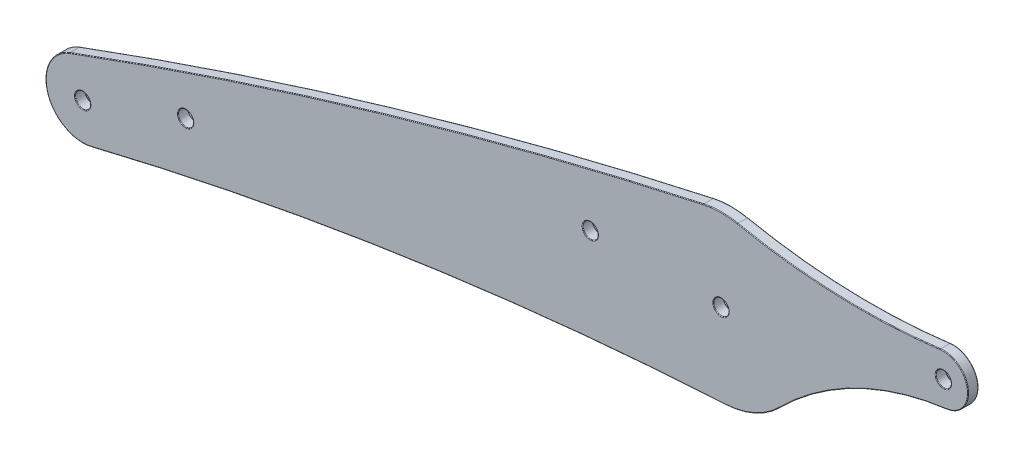
ISO-10303-21;
HEADER;
FILE_DESCRIPTION(('STEP AP214'),'2;1');
FILE_NAME('part.step','',(''),(''),'','','');
FILE_SCHEMA(('AUTOMOTIVE_DESIGN { 1 0 10303 214 1 1 1 1 }'));
ENDSEC;
DATA;
#1=APPLICATION_CONTEXT('core data for automotive mechanical design processes');
#2=APPLICATION_PROTOCOL_DEFINITION('international standard','automotive_design',2000,#1);
#3=PRODUCT_CONTEXT('',#1,'mechanical');
#4=PRODUCT('Part','Part','',(#3));
#5=PRODUCT_RELATED_PRODUCT_CATEGORY('part','',(#4));
#6=PRODUCT_DEFINITION_FORMATION('','',#4);
#7=PRODUCT_DEFINITION_CONTEXT('part definition',#1,'design');
#8=PRODUCT_DEFINITION('design','',#6,#7);
#9=PRODUCT_DEFINITION_SHAPE('','',#8);
#10=(LENGTH_UNIT() NAMED_UNIT(*) SI_UNIT(.MILLI.,.METRE.));
#11=(NAMED_UNIT(*) PLANE_ANGLE_UNIT() SI_UNIT($,.RADIAN.));
#12=(NAMED_UNIT(*) SI_UNIT($,.STERADIAN.) SOLID_ANGLE_UNIT());
#13=UNCERTAINTY_MEASURE_WITH_UNIT(LENGTH_MEASURE(1.E-05),#10,'distance_accuracy_value','');
#14=(GEOMETRIC_REPRESENTATION_CONTEXT(3) GLOBAL_UNCERTAINTY_ASSIGNED_CONTEXT((#13)) GLOBAL_UNIT_ASSIGNED_CONTEXT((#10,
#11,#12)) REPRESENTATION_CONTEXT('',''));
#15=CARTESIAN_POINT('',(0.,0.,0.));
#16=DIRECTION('',(0.,0.,1.));
#17=DIRECTION('',(1.,0.,0.));
#18=AXIS2_PLACEMENT_3D('',#15,#16,#17);
#19=CARTESIAN_POINT('',(-207.559420674233,167.991533654802,-2.5));
#20=DIRECTION('',(0.,0.,1.));
#21=DIRECTION('',(1.,0.,0.));
#22=AXIS2_PLACEMENT_3D('',#19,#20,#21);
#23=CYLINDRICAL_SURFACE('',#22,8.99999999999993);
#24=DIRECTION('',(0.,0.,1.));
#25=VECTOR('',#24,1.);
#26=CARTESIAN_POINT('',(-210.687563405126,176.430415278285,-2.5));
#27=LINE('',#26,#25);
#28=CARTESIAN_POINT('',(-210.687563405126,176.430415278285,-2.35));
#29=VERTEX_POINT('',#28);
#30=CARTESIAN_POINT('',(-210.687563405126,176.430415278285,-0.15));
#31=VERTEX_POINT('',#30);
#32=EDGE_CURVE('E152',#29,#31,#27,.T.);
#33=ORIENTED_EDGE('',*,*,#32,.F.);
#34=CARTESIAN_POINT('',(-207.559420674233,167.991533654802,-2.35));
#35=DIRECTION('',(0.,0.,1.));
#36=DIRECTION('',(1.,0.,0.));
#37=AXIS2_PLACEMENT_3D('',#34,#35,#36);
#38=CIRCLE('',#37,8.99999999999993);
#39=CARTESIAN_POINT('',(-205.431945407976,159.24660089397,-2.35));
#40=VERTEX_POINT('',#39);
#41=EDGE_CURVE('E147',#29,#40,#38,.T.);
#42=ORIENTED_EDGE('',*,*,#41,.T.);
#43=DIRECTION('',(0.,0.,1.));
#44=VECTOR('',#43,1.);
#45=CARTESIAN_POINT('',(-205.431945407976,159.24660089397,-2.5));
#46=LINE('',#45,#44);
#47=CARTESIAN_POINT('',(-205.431945407976,159.24660089397,-0.15));
#48=VERTEX_POINT('',#47);
#49=EDGE_CURVE('E149',#40,#48,#46,.T.);
#50=ORIENTED_EDGE('',*,*,#49,.T.);
#51=CARTESIAN_POINT('',(-207.559420674233,167.991533654802,-0.15));
#52=DIRECTION('',(0.,0.,1.));
#53=DIRECTION('',(1.,0.,0.));
#54=AXIS2_PLACEMENT_3D('',#51,#52,#53);
#55=CIRCLE('',#54,8.99999999999993);
#56=EDGE_CURVE('E158',#48,#31,#55,.F.);
#57=ORIENTED_EDGE('',*,*,#56,.T.);
#58=EDGE_LOOP('',(#33,#42,#50,#57));
#59=FACE_BOUND('',#58,.T.);
#60=ADVANCED_FACE('F33',(#59),#23,.T.);
#61=CARTESIAN_POINT('',(189.019563320087,-901.871125500117,-2.5));
#62=DIRECTION('',(0.,0.,1.));
#63=DIRECTION('',(1.,0.,0.));
#64=AXIS2_PLACEMENT_3D('',#61,#62,#63);
#65=CYLINDRICAL_SURFACE('',#64,1150.);
#66=DIRECTION('',(0.,0.,1.));
#67=VECTOR('',#66,1.);
#68=CARTESIAN_POINT('',(-56.8079312515751,221.547248442832,-2.5));
#69=LINE('',#68,#67);
#70=CARTESIAN_POINT('',(-56.8079312515751,221.547248442832,-2.35));
#71=VERTEX_POINT('',#70);
#72=CARTESIAN_POINT('',(-56.8079312515751,221.547248442832,-0.15));
#73=VERTEX_POINT('',#72);
#74=EDGE_CURVE('E369',#71,#73,#69,.T.);
#75=ORIENTED_EDGE('',*,*,#74,.F.);
#76=CARTESIAN_POINT('',(189.019563320087,-901.871125500117,-2.35));
#77=DIRECTION('',(0.,0.,1.));
#78=DIRECTION('',(1.,0.,0.));
#79=AXIS2_PLACEMENT_3D('',#76,#77,#78);
#80=CIRCLE('',#79,1150.);
#81=EDGE_CURVE('E241',#71,#29,#80,.T.);
#82=ORIENTED_EDGE('',*,*,#81,.T.);
#83=ORIENTED_EDGE('',*,*,#32,.T.);
#84=CARTESIAN_POINT('',(189.019563320087,-901.871125500117,-0.15));
#85=DIRECTION('',(0.,0.,1.));
#86=DIRECTION('',(1.,0.,0.));
#87=AXIS2_PLACEMENT_3D('',#84,#85,#86);
#88=CIRCLE('',#87,1150.);
#89=EDGE_CURVE('E238',#31,#73,#88,.F.);
#90=ORIENTED_EDGE('',*,*,#89,.T.);
#91=EDGE_LOOP('',(#75,#82,#83,#90));
#92=FACE_BOUND('',#91,.T.);
#93=ADVANCED_FACE('F375',(#92),#65,.T.);
#94=CARTESIAN_POINT('',(-52.5326704764156,202.00953759165,-2.5));
#95=DIRECTION('',(0.,0.,1.));
#96=DIRECTION('',(1.,0.,0.));
#97=AXIS2_PLACEMENT_3D('',#94,#95,#96);
#98=CYLINDRICAL_SURFACE('',#97,19.9999999999999);
#99=DIRECTION('',(0.,0.,1.));
#100=VECTOR('',#99,1.);
#101=CARTESIAN_POINT('',(-48.5315140921428,221.605219452422,-2.5));
#102=LINE('',#101,#100);
#103=CARTESIAN_POINT('',(-48.5315140921428,221.605219452422,-2.35));
#104=VERTEX_POINT('',#103);
#105=CARTESIAN_POINT('',(-48.5315140921428,221.605219452422,-0.15));
#106=VERTEX_POINT('',#105);
#107=EDGE_CURVE('E366',#104,#106,#102,.T.);
#108=ORIENTED_EDGE('',*,*,#107,.F.);
#109=CARTESIAN_POINT('',(-52.5326704764156,202.00953759165,-2.35));
#110=DIRECTION('',(0.,0.,1.));
#111=DIRECTION('',(1.,0.,0.));
#112=AXIS2_PLACEMENT_3D('',#109,#110,#111);
#113=CIRCLE('',#112,19.9999999999999);
#114=EDGE_CURVE('E236',#104,#71,#113,.T.);
#115=ORIENTED_EDGE('',*,*,#114,.T.);
#116=ORIENTED_EDGE('',*,*,#74,.T.);
#117=CARTESIAN_POINT('',(-52.5326704764156,202.00953759165,-0.15));
#118=DIRECTION('',(0.,0.,1.));
#119=DIRECTION('',(1.,0.,0.));
#120=AXIS2_PLACEMENT_3D('',#117,#118,#119);
#121=CIRCLE('',#120,19.9999999999999);
#122=EDGE_CURVE('E234',#73,#106,#121,.F.);
#123=ORIENTED_EDGE('',*,*,#122,.T.);
#124=EDGE_LOOP('',(#108,#115,#116,#123));
#125=FACE_BOUND('',#124,.T.);
#126=ADVANCED_FACE('F429',(#125),#98,.T.);
#127=CARTESIAN_POINT('',(-18.5228412100963,368.572833408213,-2.5));
#128=DIRECTION('',(0.,0.,1.));
#129=DIRECTION('',(1.,0.,0.));
#130=AXIS2_PLACEMENT_3D('',#127,#128,#129);
#131=CYLINDRICAL_SURFACE('',#130,150.);
#132=DIRECTION('',(0.,0.,1.));
#133=VECTOR('',#132,1.);
#134=CARTESIAN_POINT('',(0.698476803058276,219.809461122434,-2.5));
#135=LINE('',#134,#133);
#136=CARTESIAN_POINT('',(0.698476803058276,219.809461122434,-2.35));
#137=VERTEX_POINT('',#136);
#138=CARTESIAN_POINT('',(0.698476803058276,219.809461122434,-0.15));
#139=VERTEX_POINT('',#138);
#140=EDGE_CURVE('E360',#137,#139,#135,.T.);
#141=ORIENTED_EDGE('',*,*,#140,.F.);
#142=CARTESIAN_POINT('',(-18.5228412100963,368.572833408213,-2.35));
#143=DIRECTION('',(0.,0.,1.));
#144=DIRECTION('',(1.,0.,0.));
#145=AXIS2_PLACEMENT_3D('',#142,#143,#144);
#146=CIRCLE('',#145,150.);
#147=EDGE_CURVE('E232',#137,#104,#146,.F.);
#148=ORIENTED_EDGE('',*,*,#147,.T.);
#149=ORIENTED_EDGE('',*,*,#107,.T.);
#150=CARTESIAN_POINT('',(-18.5228412100963,368.572833408213,-0.15));
#151=DIRECTION('',(0.,0.,1.));
#152=DIRECTION('',(1.,0.,0.));
#153=AXIS2_PLACEMENT_3D('',#150,#151,#152);
#154=CIRCLE('',#153,150.);
#155=EDGE_CURVE('E230',#106,#139,#154,.T.);
#156=ORIENTED_EDGE('',*,*,#155,.T.);
#157=EDGE_LOOP('',(#141,#148,#149,#156));
#158=FACE_BOUND('',#157,.T.);
#159=ADVANCED_FACE('F722',(#158),#131,.F.);
#160=CARTESIAN_POINT('',(1.46732952358442,213.858926231003,-2.5));
#161=DIRECTION('',(0.,0.,1.));
#162=DIRECTION('',(1.,0.,0.));
#163=AXIS2_PLACEMENT_3D('',#160,#161,#162);
#164=CYLINDRICAL_SURFACE('',#163,5.99999999999998);
#165=DIRECTION('',(0.,0.,1.));
#166=VECTOR('',#165,1.);
#167=CARTESIAN_POINT('',(2.23764645106945,207.908580709,-2.5));
#168=LINE('',#167,#166);
#169=CARTESIAN_POINT('',(2.23764645106945,207.908580709,-2.35));
#170=VERTEX_POINT('',#169);
#171=CARTESIAN_POINT('',(2.23764645106945,207.908580709,-0.15));
#172=VERTEX_POINT('',#171);
#173=EDGE_CURVE('E356',#170,#172,#168,.T.);
#174=ORIENTED_EDGE('',*,*,#173,.F.);
#175=CARTESIAN_POINT('',(1.46732952358442,213.858926231003,-2.35));
#176=DIRECTION('',(0.,0.,1.));
#177=DIRECTION('',(1.,0.,0.));
#178=AXIS2_PLACEMENT_3D('',#175,#176,#177);
#179=CIRCLE('',#178,5.99999999999998);
#180=EDGE_CURVE('E228',#170,#137,#179,.T.);
#181=ORIENTED_EDGE('',*,*,#180,.T.);
#182=ORIENTED_EDGE('',*,*,#140,.T.);
#183=CARTESIAN_POINT('',(1.46732952358442,213.858926231003,-0.15));
#184=DIRECTION('',(0.,0.,1.));
#185=DIRECTION('',(1.,0.,0.));
#186=AXIS2_PLACEMENT_3D('',#183,#184,#185);
#187=CIRCLE('',#186,5.99999999999998);
#188=EDGE_CURVE('E226',#139,#172,#187,.F.);
#189=ORIENTED_EDGE('',*,*,#188,.T.);
#190=EDGE_LOOP('',(#174,#181,#182,#189));
#191=FACE_BOUND('',#190,.T.);
#192=ADVANCED_FACE('F714',(#191),#164,.T.);
#193=CARTESIAN_POINT('',(11.2246772717282,138.487882952289,-2.5));
#194=DIRECTION('',(0.,0.,1.));
#195=DIRECTION('',(1.,0.,0.));
#196=AXIS2_PLACEMENT_3D('',#193,#194,#195);
#197=CYLINDRICAL_SURFACE('',#196,70.);
#198=DIRECTION('',(0.,0.,1.));
#199=VECTOR('',#198,1.);
#200=CARTESIAN_POINT('',(-38.3643709768281,187.893614338459,-2.5));
#201=LINE('',#200,#199);
#202=CARTESIAN_POINT('',(-38.3643709768281,187.893614338459,-2.35));
#203=VERTEX_POINT('',#202);
#204=CARTESIAN_POINT('',(-38.3643709768281,187.893614338459,-0.15));
#205=VERTEX_POINT('',#204);
#206=EDGE_CURVE('E353',#203,#205,#201,.T.);
#207=ORIENTED_EDGE('',*,*,#206,.F.);
#208=CARTESIAN_POINT('',(11.2246772717282,138.487882952289,-2.35));
#209=DIRECTION('',(0.,0.,1.));
#210=DIRECTION('',(1.,0.,0.));
#211=AXIS2_PLACEMENT_3D('',#208,#209,#210);
#212=CIRCLE('',#211,70.);
#213=EDGE_CURVE('E224',#203,#170,#212,.F.);
#214=ORIENTED_EDGE('',*,*,#213,.T.);
#215=ORIENTED_EDGE('',*,*,#173,.T.);
#216=CARTESIAN_POINT('',(11.2246772717282,138.487882952289,-0.15));
#217=DIRECTION('',(0.,0.,1.));
#218=DIRECTION('',(1.,0.,0.));
#219=AXIS2_PLACEMENT_3D('',#216,#217,#218);
#220=CIRCLE('',#219,70.);
#221=EDGE_CURVE('E222',#172,#205,#220,.T.);
#222=ORIENTED_EDGE('',*,*,#221,.T.);
#223=EDGE_LOOP('',(#207,#214,#215,#222));
#224=FACE_BOUND('',#223,.T.);
#225=ADVANCED_FACE('F352',(#224),#197,.F.);
#226=CARTESIAN_POINT('',(-52.5326704764156,202.00953759165,-2.5));
#227=DIRECTION('',(0.,0.,1.));
#228=DIRECTION('',(1.,0.,0.));
#229=AXIS2_PLACEMENT_3D('',#226,#227,#228);
#230=CYLINDRICAL_SURFACE('',#229,20.0000000000001);
#231=DIRECTION('',(0.,0.,1.));
#232=VECTOR('',#231,1.);
#233=CARTESIAN_POINT('',(-51.4285568060865,182.04003752272,-2.5));
#234=LINE('',#233,#232);
#235=CARTESIAN_POINT('',(-51.4285568060865,182.04003752272,-2.35));
#236=VERTEX_POINT('',#235);
#237=CARTESIAN_POINT('',(-51.4285568060865,182.04003752272,-0.15));
#238=VERTEX_POINT('',#237);
#239=EDGE_CURVE('E169',#236,#238,#234,.T.);
#240=ORIENTED_EDGE('',*,*,#239,.F.);
#241=CARTESIAN_POINT('',(-52.5326704764156,202.00953759165,-2.35));
#242=DIRECTION('',(0.,0.,1.));
#243=DIRECTION('',(1.,0.,0.));
#244=AXIS2_PLACEMENT_3D('',#241,#242,#243);
#245=CIRCLE('',#244,20.0000000000001);
#246=EDGE_CURVE('E220',#236,#203,#245,.T.);
#247=ORIENTED_EDGE('',*,*,#246,.T.);
#248=ORIENTED_EDGE('',*,*,#206,.T.);
#249=CARTESIAN_POINT('',(-52.5326704764156,202.00953759165,-0.15));
#250=DIRECTION('',(0.,0.,1.));
#251=DIRECTION('',(1.,0.,0.));
#252=AXIS2_PLACEMENT_3D('',#249,#250,#251);
#253=CIRCLE('',#252,20.0000000000001);
#254=EDGE_CURVE('E218',#205,#238,#253,.F.);
#255=ORIENTED_EDGE('',*,*,#254,.T.);
#256=EDGE_LOOP('',(#240,#247,#248,#255));
#257=FACE_BOUND('',#256,.T.);
#258=ADVANCED_FACE('F358',(#257),#230,.T.);
#259=CARTESIAN_POINT('',(-4.50372581709999,-666.663715406802,-2.5));
#260=DIRECTION('',(0.,0.,1.));
#261=DIRECTION('',(1.,0.,0.));
#262=AXIS2_PLACEMENT_3D('',#259,#260,#261);
#263=CYLINDRICAL_SURFACE('',#262,850.);
#264=ORIENTED_EDGE('',*,*,#49,.F.);
#265=CARTESIAN_POINT('',(-4.50372581709999,-666.663715406802,-2.35));
#266=DIRECTION('',(0.,0.,1.));
#267=DIRECTION('',(1.,0.,0.));
#268=AXIS2_PLACEMENT_3D('',#265,#266,#267);
#269=CIRCLE('',#268,850.);
#270=EDGE_CURVE('E165',#40,#236,#269,.F.);
#271=ORIENTED_EDGE('',*,*,#270,.T.);
#272=ORIENTED_EDGE('',*,*,#239,.T.);
#273=CARTESIAN_POINT('',(-4.50372581709999,-666.663715406802,-0.15));
#274=DIRECTION('',(0.,0.,1.));
#275=DIRECTION('',(1.,0.,0.));
#276=AXIS2_PLACEMENT_3D('',#273,#274,#275);
#277=CIRCLE('',#276,850.);
#278=EDGE_CURVE('E168',#238,#48,#277,.T.);
#279=ORIENTED_EDGE('',*,*,#278,.T.);
#280=EDGE_LOOP('',(#264,#271,#272,#279));
#281=FACE_BOUND('',#280,.T.);
#282=ADVANCED_FACE('F162',(#281),#263,.F.);
#283=CARTESIAN_POINT('',(-106.031573245666,-249.336090876,-2.5));
#284=DIRECTION('',(0.,0.,1.));
#285=DIRECTION('',(1.,0.,0.));
#286=AXIS2_PLACEMENT_3D('',#283,#284,#285);
#287=PLANE('',#286);
#288=CARTESIAN_POINT('',(-52.5326704764156,202.00953759165,-2.5));
#289=DIRECTION('',(0.,0.,1.));
#290=DIRECTION('',(1.,0.,0.));
#291=AXIS2_PLACEMENT_3D('',#288,#289,#290);
#292=CIRCLE('',#291,19.8500000000001);
#293=CARTESIAN_POINT('',(-38.470633223075,187.999483762858,-2.5));
#294=VERTEX_POINT('',#293);
#295=CARTESIAN_POINT('',(-51.436837658614,182.189808773237,-2.5));
#296=VERTEX_POINT('',#295);
#297=EDGE_CURVE('E214',#294,#296,#292,.F.);
#298=ORIENTED_EDGE('',*,*,#297,.T.);
#299=CARTESIAN_POINT('',(-4.50372581709999,-666.663715406802,-2.5));
#300=DIRECTION('',(0.,0.,1.));
#301=DIRECTION('',(1.,0.,0.));
#302=AXIS2_PLACEMENT_3D('',#299,#300,#301);
#303=CIRCLE('',#302,850.15);
#304=CARTESIAN_POINT('',(-205.467403329081,159.392349773317,-2.5));
#305=VERTEX_POINT('',#304);
#306=EDGE_CURVE('E216',#296,#305,#303,.T.);
#307=ORIENTED_EDGE('',*,*,#306,.T.);
#308=CARTESIAN_POINT('',(-207.559420674233,167.991533654802,-2.5));
#309=DIRECTION('',(0.,0.,1.));
#310=DIRECTION('',(1.,0.,0.));
#311=AXIS2_PLACEMENT_3D('',#308,#309,#310);
#312=CIRCLE('',#311,8.84999999999993);
#313=CARTESIAN_POINT('',(-210.635427692944,176.289767251227,-2.5));
#314=VERTEX_POINT('',#313);
#315=EDGE_CURVE('E175',#305,#314,#312,.F.);
#316=ORIENTED_EDGE('',*,*,#315,.T.);
#317=CARTESIAN_POINT('',(189.019563320087,-901.871125500117,-2.5));
#318=DIRECTION('',(0.,0.,1.));
#319=DIRECTION('',(1.,0.,0.));
#320=AXIS2_PLACEMENT_3D('',#317,#318,#319);
#321=CIRCLE('',#320,1149.85);
#322=CARTESIAN_POINT('',(-56.7758667957613,221.400715611448,-2.5));
#323=VERTEX_POINT('',#322);
#324=EDGE_CURVE('E204',#314,#323,#321,.F.);
#325=ORIENTED_EDGE('',*,*,#324,.T.);
#326=CARTESIAN_POINT('',(-52.5326704764156,202.00953759165,-2.5));
#327=DIRECTION('',(0.,0.,1.));
#328=DIRECTION('',(1.,0.,0.));
#329=AXIS2_PLACEMENT_3D('',#326,#327,#328);
#330=CIRCLE('',#329,19.8499999999999);
#331=CARTESIAN_POINT('',(-48.5615227650248,221.458251838467,-2.5));
#332=VERTEX_POINT('',#331);
#333=EDGE_CURVE('E206',#323,#332,#330,.F.);
#334=ORIENTED_EDGE('',*,*,#333,.T.);
#335=CARTESIAN_POINT('',(-18.5228412100963,368.572833408213,-2.5));
#336=DIRECTION('',(0.,0.,1.));
#337=DIRECTION('',(1.,0.,0.));
#338=AXIS2_PLACEMENT_3D('',#335,#336,#337);
#339=CIRCLE('',#338,150.15);
#340=CARTESIAN_POINT('',(0.71769812107143,219.660697750149,-2.5));
#341=VERTEX_POINT('',#340);
#342=EDGE_CURVE('E208',#332,#341,#339,.T.);
#343=ORIENTED_EDGE('',*,*,#342,.T.);
#344=CARTESIAN_POINT('',(1.46732952358442,213.858926231003,-2.5));
#345=DIRECTION('',(0.,0.,1.));
#346=DIRECTION('',(1.,0.,0.));
#347=AXIS2_PLACEMENT_3D('',#344,#345,#346);
#348=CIRCLE('',#347,5.84999999999998);
#349=CARTESIAN_POINT('',(2.21838852788232,208.05733934705,-2.5));
#350=VERTEX_POINT('',#349);
#351=EDGE_CURVE('E210',#341,#350,#348,.F.);
#352=ORIENTED_EDGE('',*,*,#351,.T.);
#353=CARTESIAN_POINT('',(11.2246772717282,138.487882952289,-2.5));
#354=DIRECTION('',(0.,0.,1.));
#355=DIRECTION('',(1.,0.,0.));
#356=AXIS2_PLACEMENT_3D('',#353,#354,#355);
#357=CIRCLE('',#356,70.15);
#358=EDGE_CURVE('E212',#350,#294,#357,.T.);
#359=ORIENTED_EDGE('',*,*,#358,.T.);
#360=EDGE_LOOP('',(#298,#307,#316,#325,#334,#343,#352,#359));
#361=FACE_BOUND('',#360,.T.);
#362=CARTESIAN_POINT('',(1.46732952358442,213.858926231003,-2.5));
#363=DIRECTION('',(0.,0.,1.));
#364=DIRECTION('',(1.,0.,0.));
#365=AXIS2_PLACEMENT_3D('',#362,#363,#364);
#366=CIRCLE('',#365,1.99999999999999);
#367=CARTESIAN_POINT('',(3.46732952358441,213.858926231003,-2.5));
#368=VERTEX_POINT('',#367);
#369=EDGE_CURVE('E200',#368,#368,#366,.T.);
#370=ORIENTED_EDGE('',*,*,#369,.T.);
#371=EDGE_LOOP('',(#370));
#372=FACE_BOUND('',#371,.T.);
#373=CARTESIAN_POINT('',(-52.5326704764156,202.00953759165,-2.5));
#374=DIRECTION('',(0.,0.,1.));
#375=DIRECTION('',(1.,0.,0.));
#376=AXIS2_PLACEMENT_3D('',#373,#374,#375);
#377=CIRCLE('',#376,1.99999999999999);
#378=CARTESIAN_POINT('',(-50.5326704764156,202.00953759165,-2.5));
#379=VERTEX_POINT('',#378);
#380=EDGE_CURVE('E197',#379,#379,#377,.T.);
#381=ORIENTED_EDGE('',*,*,#380,.T.);
#382=EDGE_LOOP('',(#381));
#383=FACE_BOUND('',#382,.T.);
#384=CARTESIAN_POINT('',(-84.2826704764156,202.216511620711,-2.5));
#385=DIRECTION('',(0.,0.,1.));
#386=DIRECTION('',(1.,0.,0.));
#387=AXIS2_PLACEMENT_3D('',#384,#385,#386);
#388=CIRCLE('',#387,2.);
#389=CARTESIAN_POINT('',(-82.2826704764156,202.216511620711,-2.5));
#390=VERTEX_POINT('',#389);
#391=EDGE_CURVE('E194',#390,#390,#388,.T.);
#392=ORIENTED_EDGE('',*,*,#391,.T.);
#393=EDGE_LOOP('',(#392));
#394=FACE_BOUND('',#393,.T.);
#395=CARTESIAN_POINT('',(-182.559420674233,176.697772359895,-2.5));
#396=DIRECTION('',(0.,0.,1.));
#397=DIRECTION('',(1.,0.,0.));
#398=AXIS2_PLACEMENT_3D('',#395,#396,#397);
#399=CIRCLE('',#398,1.99999999999999);
#400=CARTESIAN_POINT('',(-180.559420674233,176.697772359895,-2.5));
#401=VERTEX_POINT('',#400);
#402=EDGE_CURVE('E188',#401,#401,#399,.T.);
#403=ORIENTED_EDGE('',*,*,#402,.T.);
#404=EDGE_LOOP('',(#403));
#405=FACE_BOUND('',#404,.T.);
#406=CARTESIAN_POINT('',(-207.559420674233,167.991533654802,-2.5));
#407=DIRECTION('',(0.,0.,1.));
#408=DIRECTION('',(1.,0.,0.));
#409=AXIS2_PLACEMENT_3D('',#406,#407,#408);
#410=CIRCLE('',#409,1.99999999999999);
#411=CARTESIAN_POINT('',(-205.559420674233,167.991533654802,-2.5));
#412=VERTEX_POINT('',#411);
#413=EDGE_CURVE('E185',#412,#412,#410,.T.);
#414=ORIENTED_EDGE('',*,*,#413,.T.);
#415=EDGE_LOOP('',(#414));
#416=FACE_BOUND('',#415,.T.);
#417=ADVANCED_FACE('F391',(#361,#372,#383,#394,#405,#416),#287,.F.);
#418=CARTESIAN_POINT('',(-106.031573245666,-249.336090876,0.));
#419=DIRECTION('',(0.,0.,1.));
#420=DIRECTION('',(1.,0.,0.));
#421=AXIS2_PLACEMENT_3D('',#418,#419,#420);
#422=PLANE('',#421);
#423=CARTESIAN_POINT('',(-52.5326704764156,202.00953759165,0.));
#424=DIRECTION('',(0.,0.,1.));
#425=DIRECTION('',(1.,0.,0.));
#426=AXIS2_PLACEMENT_3D('',#423,#424,#425);
#427=CIRCLE('',#426,19.8499999999999);
#428=CARTESIAN_POINT('',(-48.5615227650248,221.458251838467,0.));
#429=VERTEX_POINT('',#428);
#430=CARTESIAN_POINT('',(-56.7758667957614,221.400715611448,0.));
#431=VERTEX_POINT('',#430);
#432=EDGE_CURVE('E42',#429,#431,#427,.T.);
#433=ORIENTED_EDGE('',*,*,#432,.T.);
#434=CARTESIAN_POINT('',(189.019563320087,-901.871125500117,0.));
#435=DIRECTION('',(0.,0.,1.));
#436=DIRECTION('',(1.,0.,0.));
#437=AXIS2_PLACEMENT_3D('',#434,#435,#436);
#438=CIRCLE('',#437,1149.85);
#439=CARTESIAN_POINT('',(-210.635427692944,176.289767251227,0.));
#440=VERTEX_POINT('',#439);
#441=EDGE_CURVE('E11',#431,#440,#438,.T.);
#442=ORIENTED_EDGE('',*,*,#441,.T.);
#443=CARTESIAN_POINT('',(-207.559420674233,167.991533654802,0.));
#444=DIRECTION('',(0.,0.,1.));
#445=DIRECTION('',(1.,0.,0.));
#446=AXIS2_PLACEMENT_3D('',#443,#444,#445);
#447=CIRCLE('',#446,8.84999999999993);
#448=CARTESIAN_POINT('',(-205.467403329081,159.392349773317,0.));
#449=VERTEX_POINT('',#448);
#450=EDGE_CURVE('E288',#440,#449,#447,.T.);
#451=ORIENTED_EDGE('',*,*,#450,.T.);
#452=CARTESIAN_POINT('',(-4.50372581709999,-666.663715406802,0.));
#453=DIRECTION('',(0.,0.,1.));
#454=DIRECTION('',(1.,0.,0.));
#455=AXIS2_PLACEMENT_3D('',#452,#453,#454);
#456=CIRCLE('',#455,850.15);
#457=CARTESIAN_POINT('',(-51.436837658614,182.189808773237,0.));
#458=VERTEX_POINT('',#457);
#459=EDGE_CURVE('E290',#449,#458,#456,.F.);
#460=ORIENTED_EDGE('',*,*,#459,.T.);
#461=CARTESIAN_POINT('',(-52.5326704764156,202.00953759165,0.));
#462=DIRECTION('',(0.,0.,1.));
#463=DIRECTION('',(1.,0.,0.));
#464=AXIS2_PLACEMENT_3D('',#461,#462,#463);
#465=CIRCLE('',#464,19.8500000000001);
#466=CARTESIAN_POINT('',(-38.4706332230749,187.999483762858,0.));
#467=VERTEX_POINT('',#466);
#468=EDGE_CURVE('E292',#458,#467,#465,.T.);
#469=ORIENTED_EDGE('',*,*,#468,.T.);
#470=CARTESIAN_POINT('',(11.2246772717282,138.487882952289,0.));
#471=DIRECTION('',(0.,0.,1.));
#472=DIRECTION('',(1.,0.,0.));
#473=AXIS2_PLACEMENT_3D('',#470,#471,#472);
#474=CIRCLE('',#473,70.15);
#475=CARTESIAN_POINT('',(2.21838852788233,208.05733934705,0.));
#476=VERTEX_POINT('',#475);
#477=EDGE_CURVE('E294',#467,#476,#474,.F.);
#478=ORIENTED_EDGE('',*,*,#477,.T.);
#479=CARTESIAN_POINT('',(1.46732952358442,213.858926231003,0.));
#480=DIRECTION('',(0.,0.,1.));
#481=DIRECTION('',(1.,0.,0.));
#482=AXIS2_PLACEMENT_3D('',#479,#480,#481);
#483=CIRCLE('',#482,5.84999999999998);
#484=CARTESIAN_POINT('',(0.717698121071431,219.660697750149,0.));
#485=VERTEX_POINT('',#484);
#486=EDGE_CURVE('E296',#476,#485,#483,.T.);
#487=ORIENTED_EDGE('',*,*,#486,.T.);
#488=CARTESIAN_POINT('',(-18.5228412100963,368.572833408213,0.));
#489=DIRECTION('',(0.,0.,1.));
#490=DIRECTION('',(1.,0.,0.));
#491=AXIS2_PLACEMENT_3D('',#488,#489,#490);
#492=CIRCLE('',#491,150.15);
#493=EDGE_CURVE('E53',#485,#429,#492,.F.);
#494=ORIENTED_EDGE('',*,*,#493,.T.);
#495=EDGE_LOOP('',(#433,#442,#451,#460,#469,#478,#487,#494));
#496=FACE_BOUND('',#495,.T.);
#497=CARTESIAN_POINT('',(1.46732952358442,213.858926231003,0.));
#498=DIRECTION('',(0.,0.,1.));
#499=DIRECTION('',(1.,0.,0.));
#500=AXIS2_PLACEMENT_3D('',#497,#498,#499);
#501=CIRCLE('',#500,1.99999999999999);
#502=CARTESIAN_POINT('',(3.46732952358441,213.858926231003,0.));
#503=VERTEX_POINT('',#502);
#504=EDGE_CURVE('E285',#503,#503,#501,.F.);
#505=ORIENTED_EDGE('',*,*,#504,.T.);
#506=EDGE_LOOP('',(#505));
#507=FACE_BOUND('',#506,.T.);
#508=CARTESIAN_POINT('',(-52.5326704764156,202.00953759165,0.));
#509=DIRECTION('',(0.,0.,1.));
#510=DIRECTION('',(1.,0.,0.));
#511=AXIS2_PLACEMENT_3D('',#508,#509,#510);
#512=CIRCLE('',#511,1.99999999999999);
#513=CARTESIAN_POINT('',(-50.5326704764156,202.00953759165,0.));
#514=VERTEX_POINT('',#513);
#515=EDGE_CURVE('E282',#514,#514,#512,.F.);
#516=ORIENTED_EDGE('',*,*,#515,.T.);
#517=EDGE_LOOP('',(#516));
#518=FACE_BOUND('',#517,.T.);
#519=CARTESIAN_POINT('',(-84.2826704764156,202.216511620711,0.));
#520=DIRECTION('',(0.,0.,1.));
#521=DIRECTION('',(1.,0.,0.));
#522=AXIS2_PLACEMENT_3D('',#519,#520,#521);
#523=CIRCLE('',#522,2.);
#524=CARTESIAN_POINT('',(-82.2826704764156,202.216511620711,0.));
#525=VERTEX_POINT('',#524);
#526=EDGE_CURVE('E279',#525,#525,#523,.F.);
#527=ORIENTED_EDGE('',*,*,#526,.T.);
#528=EDGE_LOOP('',(#527));
#529=FACE_BOUND('',#528,.T.);
#530=CARTESIAN_POINT('',(-182.559420674233,176.697772359895,0.));
#531=DIRECTION('',(0.,0.,1.));
#532=DIRECTION('',(1.,0.,0.));
#533=AXIS2_PLACEMENT_3D('',#530,#531,#532);
#534=CIRCLE('',#533,1.99999999999999);
#535=CARTESIAN_POINT('',(-180.559420674233,176.697772359895,0.));
#536=VERTEX_POINT('',#535);
#537=EDGE_CURVE('E276',#536,#536,#534,.F.);
#538=ORIENTED_EDGE('',*,*,#537,.T.);
#539=EDGE_LOOP('',(#538));
#540=FACE_BOUND('',#539,.T.);
#541=CARTESIAN_POINT('',(-207.559420674233,167.991533654802,0.));
#542=DIRECTION('',(0.,0.,1.));
#543=DIRECTION('',(1.,0.,0.));
#544=AXIS2_PLACEMENT_3D('',#541,#542,#543);
#545=CIRCLE('',#544,1.99999999999999);
#546=CARTESIAN_POINT('',(-205.559420674233,167.991533654802,0.));
#547=VERTEX_POINT('',#546);
#548=EDGE_CURVE('E273',#547,#547,#545,.F.);
#549=ORIENTED_EDGE('',*,*,#548,.T.);
#550=EDGE_LOOP('',(#549));
#551=FACE_BOUND('',#550,.T.);
#552=ADVANCED_FACE('F387',(#496,#507,#518,#529,#540,#551),#422,.T.);
#553=CARTESIAN_POINT('',(1.46732952358442,213.858926231003,0.));
#554=DIRECTION('',(0.,0.,1.));
#555=DIRECTION('',(1.,0.,0.));
#556=AXIS2_PLACEMENT_3D('',#553,#554,#555);
#557=CYLINDRICAL_SURFACE('',#556,1.84999999999999);
#558=CARTESIAN_POINT('',(1.46732952358442,213.858926231003,-2.35));
#559=DIRECTION('',(0.,0.,1.));
#560=DIRECTION('',(1.,0.,0.));
#561=AXIS2_PLACEMENT_3D('',#558,#559,#560);
#562=CIRCLE('',#561,1.84999999999999);
#563=CARTESIAN_POINT('',(3.31732952358441,213.858926231003,-2.35));
#564=VERTEX_POINT('',#563);
#565=EDGE_CURVE('E246',#564,#564,#562,.F.);
#566=ORIENTED_EDGE('',*,*,#565,.T.);
#567=EDGE_LOOP('',(#566));
#568=FACE_BOUND('',#567,.T.);
#569=CARTESIAN_POINT('',(1.46732952358442,213.858926231003,-0.15));
#570=DIRECTION('',(0.,0.,1.));
#571=DIRECTION('',(1.,0.,0.));
#572=AXIS2_PLACEMENT_3D('',#569,#570,#571);
#573=CIRCLE('',#572,1.84999999999999);
#574=CARTESIAN_POINT('',(3.31732952358441,213.858926231003,-0.15));
#575=VERTEX_POINT('',#574);
#576=EDGE_CURVE('E157',#575,#575,#573,.T.);
#577=ORIENTED_EDGE('',*,*,#576,.T.);
#578=EDGE_LOOP('',(#577));
#579=FACE_BOUND('',#578,.T.);
#580=ADVANCED_FACE('F390',(#568,#579),#557,.F.);
#581=CARTESIAN_POINT('',(-52.5326704764156,202.00953759165,0.));
#582=DIRECTION('',(0.,0.,1.));
#583=DIRECTION('',(1.,0.,0.));
#584=AXIS2_PLACEMENT_3D('',#581,#582,#583);
#585=CYLINDRICAL_SURFACE('',#584,1.84999999999999);
#586=CARTESIAN_POINT('',(-52.5326704764156,202.00953759165,-2.35));
#587=DIRECTION('',(0.,0.,1.));
#588=DIRECTION('',(1.,0.,0.));
#589=AXIS2_PLACEMENT_3D('',#586,#587,#588);
#590=CIRCLE('',#589,1.84999999999999);
#591=CARTESIAN_POINT('',(-50.6826704764156,202.00953759165,-2.35));
#592=VERTEX_POINT('',#591);
#593=EDGE_CURVE('E252',#592,#592,#590,.F.);
#594=ORIENTED_EDGE('',*,*,#593,.T.);
#595=EDGE_LOOP('',(#594));
#596=FACE_BOUND('',#595,.T.);
#597=CARTESIAN_POINT('',(-52.5326704764156,202.00953759165,-0.15));
#598=DIRECTION('',(0.,0.,1.));
#599=DIRECTION('',(1.,0.,0.));
#600=AXIS2_PLACEMENT_3D('',#597,#598,#599);
#601=CIRCLE('',#600,1.84999999999999);
#602=CARTESIAN_POINT('',(-50.6826704764156,202.00953759165,-0.15));
#603=VERTEX_POINT('',#602);
#604=EDGE_CURVE('E249',#603,#603,#601,.T.);
#605=ORIENTED_EDGE('',*,*,#604,.T.);
#606=EDGE_LOOP('',(#605));
#607=FACE_BOUND('',#606,.T.);
#608=ADVANCED_FACE('F664',(#596,#607),#585,.F.);
#609=CARTESIAN_POINT('',(-84.2826704764156,202.216511620711,0.));
#610=DIRECTION('',(0.,0.,1.));
#611=DIRECTION('',(1.,0.,0.));
#612=AXIS2_PLACEMENT_3D('',#609,#610,#611);
#613=CYLINDRICAL_SURFACE('',#612,1.85);
#614=CARTESIAN_POINT('',(-84.2826704764156,202.216511620711,-2.35));
#615=DIRECTION('',(0.,0.,1.));
#616=DIRECTION('',(1.,0.,0.));
#617=AXIS2_PLACEMENT_3D('',#614,#615,#616);
#618=CIRCLE('',#617,1.85);
#619=CARTESIAN_POINT('',(-82.4326704764156,202.216511620711,-2.35));
#620=VERTEX_POINT('',#619);
#621=EDGE_CURVE('E258',#620,#620,#618,.F.);
#622=ORIENTED_EDGE('',*,*,#621,.T.);
#623=EDGE_LOOP('',(#622));
#624=FACE_BOUND('',#623,.T.);
#625=CARTESIAN_POINT('',(-84.2826704764156,202.216511620711,-0.15));
#626=DIRECTION('',(0.,0.,1.));
#627=DIRECTION('',(1.,0.,0.));
#628=AXIS2_PLACEMENT_3D('',#625,#626,#627);
#629=CIRCLE('',#628,1.85);
#630=CARTESIAN_POINT('',(-82.4326704764156,202.216511620711,-0.15));
#631=VERTEX_POINT('',#630);
#632=EDGE_CURVE('E255',#631,#631,#629,.T.);
#633=ORIENTED_EDGE('',*,*,#632,.T.);
#634=EDGE_LOOP('',(#633));
#635=FACE_BOUND('',#634,.T.);
#636=ADVANCED_FACE('F421',(#624,#635),#613,.F.);
#637=CARTESIAN_POINT('',(-182.559420674233,176.697772359895,0.));
#638=DIRECTION('',(0.,0.,1.));
#639=DIRECTION('',(1.,0.,0.));
#640=AXIS2_PLACEMENT_3D('',#637,#638,#639);
#641=CYLINDRICAL_SURFACE('',#640,1.84999999999999);
#642=CARTESIAN_POINT('',(-182.559420674233,176.697772359895,-2.35));
#643=DIRECTION('',(0.,0.,1.));
#644=DIRECTION('',(1.,0.,0.));
#645=AXIS2_PLACEMENT_3D('',#642,#643,#644);
#646=CIRCLE('',#645,1.84999999999999);
#647=CARTESIAN_POINT('',(-180.709420674233,176.697772359895,-2.35));
#648=VERTEX_POINT('',#647);
#649=EDGE_CURVE('E264',#648,#648,#646,.F.);
#650=ORIENTED_EDGE('',*,*,#649,.T.);
#651=EDGE_LOOP('',(#650));
#652=FACE_BOUND('',#651,.T.);
#653=CARTESIAN_POINT('',(-182.559420674233,176.697772359895,-0.15));
#654=DIRECTION('',(0.,0.,1.));
#655=DIRECTION('',(1.,0.,0.));
#656=AXIS2_PLACEMENT_3D('',#653,#654,#655);
#657=CIRCLE('',#656,1.84999999999999);
#658=CARTESIAN_POINT('',(-180.709420674233,176.697772359895,-0.15));
#659=VERTEX_POINT('',#658);
#660=EDGE_CURVE('E261',#659,#659,#657,.T.);
#661=ORIENTED_EDGE('',*,*,#660,.T.);
#662=EDGE_LOOP('',(#661));
#663=FACE_BOUND('',#662,.T.);
#664=ADVANCED_FACE('F411',(#652,#663),#641,.F.);
#665=CARTESIAN_POINT('',(-207.559420674233,167.991533654802,0.));
#666=DIRECTION('',(0.,0.,1.));
#667=DIRECTION('',(1.,0.,0.));
#668=AXIS2_PLACEMENT_3D('',#665,#666,#667);
#669=CYLINDRICAL_SURFACE('',#668,1.84999999999999);
#670=CARTESIAN_POINT('',(-207.559420674233,167.991533654802,-2.35));
#671=DIRECTION('',(0.,0.,1.));
#672=DIRECTION('',(1.,0.,0.));
#673=AXIS2_PLACEMENT_3D('',#670,#671,#672);
#674=CIRCLE('',#673,1.84999999999999);
#675=CARTESIAN_POINT('',(-205.709420674233,167.991533654802,-2.35));
#676=VERTEX_POINT('',#675);
#677=EDGE_CURVE('E270',#676,#676,#674,.F.);
#678=ORIENTED_EDGE('',*,*,#677,.T.);
#679=EDGE_LOOP('',(#678));
#680=FACE_BOUND('',#679,.T.);
#681=CARTESIAN_POINT('',(-207.559420674233,167.991533654802,-0.15));
#682=DIRECTION('',(0.,0.,1.));
#683=DIRECTION('',(1.,0.,0.));
#684=AXIS2_PLACEMENT_3D('',#681,#682,#683);
#685=CIRCLE('',#684,1.84999999999999);
#686=CARTESIAN_POINT('',(-205.709420674233,167.991533654802,-0.15));
#687=VERTEX_POINT('',#686);
#688=EDGE_CURVE('E267',#687,#687,#685,.T.);
#689=ORIENTED_EDGE('',*,*,#688,.T.);
#690=EDGE_LOOP('',(#689));
#691=FACE_BOUND('',#690,.T.);
#692=ADVANCED_FACE('F408',(#680,#691),#669,.F.);
#693=CARTESIAN_POINT('',(-18.5228412100963,368.572833408213,-2.35));
#694=DIRECTION('',(0.,0.,1.));
#695=DIRECTION('',(1.,0.,0.));
#696=AXIS2_PLACEMENT_3D('',#693,#694,#695);
#697=TOROIDAL_SURFACE('',#696,150.15,0.15);
#698=CARTESIAN_POINT('',(0.71769812107143,219.660697750149,-2.35));
#699=DIRECTION('',(0.991755815238526,0.128142120087688,0.));
#700=DIRECTION('',(-0.128142120087688,0.991755815238526,0.));
#701=AXIS2_PLACEMENT_3D('',#698,#699,#700);
#702=CIRCLE('',#701,0.15);
#703=EDGE_CURVE('E311',#341,#137,#702,.T.);
#704=ORIENTED_EDGE('',*,*,#703,.F.);
#705=ORIENTED_EDGE('',*,*,#342,.F.);
#706=CARTESIAN_POINT('',(-48.5615227650248,221.458251838467,-2.35));
#707=DIRECTION('',(-0.979784093038607,0.200057819213632,0.));
#708=DIRECTION('',(-0.200057819213632,-0.979784093038607,0.));
#709=AXIS2_PLACEMENT_3D('',#706,#707,#708);
#710=CIRCLE('',#709,0.15);
#711=EDGE_CURVE('E170',#104,#332,#710,.T.);
#712=ORIENTED_EDGE('',*,*,#711,.F.);
#713=ORIENTED_EDGE('',*,*,#147,.F.);
#714=EDGE_LOOP('',(#704,#705,#712,#713));
#715=FACE_BOUND('',#714,.T.);
#716=ADVANCED_FACE('F410',(#715),#697,.T.);
#717=CARTESIAN_POINT('',(-52.5326704764156,202.00953759165,-2.35));
#718=DIRECTION('',(0.,0.,1.));
#719=DIRECTION('',(1.,0.,0.));
#720=AXIS2_PLACEMENT_3D('',#717,#718,#719);
#721=TOROIDAL_SURFACE('',#720,19.8499999999999,0.15);
#722=ORIENTED_EDGE('',*,*,#711,.T.);
#723=ORIENTED_EDGE('',*,*,#333,.F.);
#724=CARTESIAN_POINT('',(-56.7758667957614,221.400715611448,-2.35));
#725=DIRECTION('',(-0.97688554255908,-0.213763038757994,0.));
#726=DIRECTION('',(0.213763038757994,-0.97688554255908,0.));
#727=AXIS2_PLACEMENT_3D('',#724,#725,#726);
#728=CIRCLE('',#727,0.15);
#729=EDGE_CURVE('E308',#71,#323,#728,.T.);
#730=ORIENTED_EDGE('',*,*,#729,.F.);
#731=ORIENTED_EDGE('',*,*,#114,.F.);
#732=EDGE_LOOP('',(#722,#723,#730,#731));
#733=FACE_BOUND('',#732,.T.);
#734=ADVANCED_FACE('F418',(#733),#721,.T.);
#735=CARTESIAN_POINT('',(1.46732952358442,213.858926231003,-2.35));
#736=DIRECTION('',(0.,0.,1.));
#737=DIRECTION('',(1.,0.,0.));
#738=AXIS2_PLACEMENT_3D('',#735,#736,#737);
#739=TOROIDAL_SURFACE('',#738,5.84999999999998,0.15);
#740=ORIENTED_EDGE('',*,*,#703,.T.);
#741=ORIENTED_EDGE('',*,*,#180,.F.);
#742=CARTESIAN_POINT('',(2.21838852788232,208.05733934705,-2.35));
#743=DIRECTION('',(-0.991724253667289,-0.128386154580855,0.));
#744=DIRECTION('',(0.128386154580855,-0.991724253667289,0.));
#745=AXIS2_PLACEMENT_3D('',#742,#743,#744);
#746=CIRCLE('',#745,0.15);
#747=EDGE_CURVE('E305',#350,#170,#746,.T.);
#748=ORIENTED_EDGE('',*,*,#747,.F.);
#749=ORIENTED_EDGE('',*,*,#351,.F.);
#750=EDGE_LOOP('',(#740,#741,#748,#749));
#751=FACE_BOUND('',#750,.T.);
#752=ADVANCED_FACE('F450',(#751),#739,.T.);
#753=CARTESIAN_POINT('',(189.019563320087,-901.871125500117,-2.35));
#754=DIRECTION('',(0.,0.,1.));
#755=DIRECTION('',(1.,0.,0.));
#756=AXIS2_PLACEMENT_3D('',#753,#754,#755);
#757=TOROIDAL_SURFACE('',#756,1149.85,0.15);
#758=ORIENTED_EDGE('',*,*,#729,.T.);
#759=ORIENTED_EDGE('',*,*,#324,.F.);
#760=CARTESIAN_POINT('',(-210.635427692944,176.289767251227,-2.35));
#761=DIRECTION('',(-0.937653513720353,-0.347571414543654,0.));
#762=DIRECTION('',(0.347571414543654,-0.937653513720353,0.));
#763=AXIS2_PLACEMENT_3D('',#760,#761,#762);
#764=CIRCLE('',#763,0.15);
#765=EDGE_CURVE('E303',#29,#314,#764,.T.);
#766=ORIENTED_EDGE('',*,*,#765,.F.);
#767=ORIENTED_EDGE('',*,*,#81,.F.);
#768=EDGE_LOOP('',(#758,#759,#766,#767));
#769=FACE_BOUND('',#768,.T.);
#770=ADVANCED_FACE('F446',(#769),#757,.T.);
#771=CARTESIAN_POINT('',(11.2246772717282,138.487882952289,-2.35));
#772=DIRECTION('',(0.,0.,1.));
#773=DIRECTION('',(1.,0.,0.));
#774=AXIS2_PLACEMENT_3D('',#771,#772,#773);
#775=TOROIDAL_SURFACE('',#774,70.15,0.15);
#776=ORIENTED_EDGE('',*,*,#747,.T.);
#777=ORIENTED_EDGE('',*,*,#213,.F.);
#778=CARTESIAN_POINT('',(-38.470633223075,187.999483762858,-2.35));
#779=DIRECTION('',(-0.705796162659513,-0.708414974979429,0.));
#780=DIRECTION('',(0.70841497497943,-0.705796162659514,0.));
#781=AXIS2_PLACEMENT_3D('',#778,#779,#780);
#782=CIRCLE('',#781,0.15);
#783=EDGE_CURVE('E179',#294,#203,#782,.T.);
#784=ORIENTED_EDGE('',*,*,#783,.F.);
#785=ORIENTED_EDGE('',*,*,#358,.F.);
#786=EDGE_LOOP('',(#776,#777,#784,#785));
#787=FACE_BOUND('',#786,.T.);
#788=ADVANCED_FACE('F443',(#787),#775,.T.);
#789=CARTESIAN_POINT('',(-207.559420674233,167.991533654802,-2.35));
#790=DIRECTION('',(0.,0.,1.));
#791=DIRECTION('',(1.,0.,0.));
#792=AXIS2_PLACEMENT_3D('',#789,#790,#791);
#793=TOROIDAL_SURFACE('',#792,8.84999999999993,0.15);
#794=ORIENTED_EDGE('',*,*,#765,.T.);
#795=ORIENTED_EDGE('',*,*,#315,.F.);
#796=CARTESIAN_POINT('',(-205.467403329081,159.392349773317,-2.35));
#797=DIRECTION('',(0.971659195647982,0.236386140695084,0.));
#798=DIRECTION('',(-0.236386140695084,0.971659195647982,0.));
#799=AXIS2_PLACEMENT_3D('',#796,#797,#798);
#800=CIRCLE('',#799,0.15);
#801=EDGE_CURVE('E173',#40,#305,#800,.T.);
#802=ORIENTED_EDGE('',*,*,#801,.F.);
#803=ORIENTED_EDGE('',*,*,#41,.F.);
#804=EDGE_LOOP('',(#794,#795,#802,#803));
#805=FACE_BOUND('',#804,.T.);
#806=ADVANCED_FACE('F174',(#805),#793,.T.);
#807=CARTESIAN_POINT('',(-52.5326704764156,202.00953759165,-2.35));
#808=DIRECTION('',(0.,0.,1.));
#809=DIRECTION('',(1.,0.,0.));
#810=AXIS2_PLACEMENT_3D('',#807,#808,#809);
#811=TOROIDAL_SURFACE('',#810,19.8500000000001,0.15);
#812=ORIENTED_EDGE('',*,*,#783,.T.);
#813=ORIENTED_EDGE('',*,*,#246,.F.);
#814=CARTESIAN_POINT('',(-51.436837658614,182.189808773237,-2.35));
#815=DIRECTION('',(-0.998475003446495,-0.0552056835164823,0.));
#816=DIRECTION('',(0.0552056835164823,-0.998475003446495,0.));
#817=AXIS2_PLACEMENT_3D('',#814,#815,#816);
#818=CIRCLE('',#817,0.15);
#819=EDGE_CURVE('E180',#296,#236,#818,.T.);
#820=ORIENTED_EDGE('',*,*,#819,.F.);
#821=ORIENTED_EDGE('',*,*,#297,.F.);
#822=EDGE_LOOP('',(#812,#813,#820,#821));
#823=FACE_BOUND('',#822,.T.);
#824=ADVANCED_FACE('F437',(#823),#811,.T.);
#825=CARTESIAN_POINT('',(-4.50372581709999,-666.663715406802,-2.35));
#826=DIRECTION('',(0.,0.,1.));
#827=DIRECTION('',(1.,0.,0.));
#828=AXIS2_PLACEMENT_3D('',#825,#826,#827);
#829=TOROIDAL_SURFACE('',#828,850.15,0.15);
#830=ORIENTED_EDGE('',*,*,#801,.T.);
#831=ORIENTED_EDGE('',*,*,#306,.F.);
#832=ORIENTED_EDGE('',*,*,#819,.T.);
#833=ORIENTED_EDGE('',*,*,#270,.F.);
#834=EDGE_LOOP('',(#830,#831,#832,#833));
#835=FACE_BOUND('',#834,.T.);
#836=ADVANCED_FACE('F182',(#835),#829,.T.);
#837=CARTESIAN_POINT('',(1.46732952358442,213.858926231003,-2.35));
#838=DIRECTION('',(0.,0.,1.));
#839=DIRECTION('',(1.,0.,0.));
#840=AXIS2_PLACEMENT_3D('',#837,#838,#839);
#841=TOROIDAL_SURFACE('',#840,1.99999999999999,0.15);
#842=ORIENTED_EDGE('',*,*,#565,.F.);
#843=EDGE_LOOP('',(#842));
#844=FACE_BOUND('',#843,.T.);
#845=ORIENTED_EDGE('',*,*,#369,.F.);
#846=EDGE_LOOP('',(#845));
#847=FACE_BOUND('',#846,.T.);
#848=ADVANCED_FACE('F436',(#844,#847),#841,.T.);
#849=CARTESIAN_POINT('',(-52.5326704764156,202.00953759165,-2.35));
#850=DIRECTION('',(0.,0.,1.));
#851=DIRECTION('',(1.,0.,0.));
#852=AXIS2_PLACEMENT_3D('',#849,#850,#851);
#853=TOROIDAL_SURFACE('',#852,1.99999999999999,0.15);
#854=ORIENTED_EDGE('',*,*,#593,.F.);
#855=EDGE_LOOP('',(#854));
#856=FACE_BOUND('',#855,.T.);
#857=ORIENTED_EDGE('',*,*,#380,.F.);
#858=EDGE_LOOP('',(#857));
#859=FACE_BOUND('',#858,.T.);
#860=ADVANCED_FACE('F460',(#856,#859),#853,.T.);
#861=CARTESIAN_POINT('',(-84.2826704764156,202.216511620711,-2.35));
#862=DIRECTION('',(0.,0.,1.));
#863=DIRECTION('',(1.,0.,0.));
#864=AXIS2_PLACEMENT_3D('',#861,#862,#863);
#865=TOROIDAL_SURFACE('',#864,2.,0.15);
#866=ORIENTED_EDGE('',*,*,#621,.F.);
#867=EDGE_LOOP('',(#866));
#868=FACE_BOUND('',#867,.T.);
#869=ORIENTED_EDGE('',*,*,#391,.F.);
#870=EDGE_LOOP('',(#869));
#871=FACE_BOUND('',#870,.T.);
#872=ADVANCED_FACE('F464',(#868,#871),#865,.T.);
#873=CARTESIAN_POINT('',(-182.559420674233,176.697772359895,-2.35));
#874=DIRECTION('',(0.,0.,1.));
#875=DIRECTION('',(1.,0.,0.));
#876=AXIS2_PLACEMENT_3D('',#873,#874,#875);
#877=TOROIDAL_SURFACE('',#876,1.99999999999999,0.15);
#878=ORIENTED_EDGE('',*,*,#649,.F.);
#879=EDGE_LOOP('',(#878));
#880=FACE_BOUND('',#879,.T.);
#881=ORIENTED_EDGE('',*,*,#402,.F.);
#882=EDGE_LOOP('',(#881));
#883=FACE_BOUND('',#882,.T.);
#884=ADVANCED_FACE('F468',(#880,#883),#877,.T.);
#885=CARTESIAN_POINT('',(-207.559420674233,167.991533654802,-2.35));
#886=DIRECTION('',(0.,0.,1.));
#887=DIRECTION('',(1.,0.,0.));
#888=AXIS2_PLACEMENT_3D('',#885,#886,#887);
#889=TOROIDAL_SURFACE('',#888,1.99999999999999,0.15);
#890=ORIENTED_EDGE('',*,*,#677,.F.);
#891=EDGE_LOOP('',(#890));
#892=FACE_BOUND('',#891,.T.);
#893=ORIENTED_EDGE('',*,*,#413,.F.);
#894=EDGE_LOOP('',(#893));
#895=FACE_BOUND('',#894,.T.);
#896=ADVANCED_FACE('F472',(#892,#895),#889,.T.);
#897=CARTESIAN_POINT('',(11.2246772717282,138.487882952289,-0.15));
#898=DIRECTION('',(0.,0.,1.));
#899=DIRECTION('',(1.,0.,0.));
#900=AXIS2_PLACEMENT_3D('',#897,#898,#899);
#901=TOROIDAL_SURFACE('',#900,70.15,0.15);
#902=CARTESIAN_POINT('',(-38.470633223075,187.999483762858,-0.15));
#903=DIRECTION('',(-0.705796162659583,-0.70841497497936,0.));
#904=DIRECTION('',(0.70841497497936,-0.705796162659583,0.));
#905=AXIS2_PLACEMENT_3D('',#902,#903,#904);
#906=CIRCLE('',#905,0.15);
#907=EDGE_CURVE('E331',#205,#467,#906,.T.);
#908=ORIENTED_EDGE('',*,*,#907,.F.);
#909=ORIENTED_EDGE('',*,*,#221,.F.);
#910=CARTESIAN_POINT('',(2.21838852788233,208.05733934705,-0.15));
#911=DIRECTION('',(0.99172425366729,0.128386154580849,0.));
#912=DIRECTION('',(-0.128386154580849,0.99172425366729,0.));
#913=AXIS2_PLACEMENT_3D('',#910,#911,#912);
#914=CIRCLE('',#913,0.15);
#915=EDGE_CURVE('E37',#476,#172,#914,.T.);
#916=ORIENTED_EDGE('',*,*,#915,.F.);
#917=ORIENTED_EDGE('',*,*,#477,.F.);
#918=EDGE_LOOP('',(#908,#909,#916,#917));
#919=FACE_BOUND('',#918,.T.);
#920=ADVANCED_FACE('F347',(#919),#901,.T.);
#921=CARTESIAN_POINT('',(1.46732952358442,213.858926231003,-0.15));
#922=DIRECTION('',(0.,0.,1.));
#923=DIRECTION('',(1.,0.,0.));
#924=AXIS2_PLACEMENT_3D('',#921,#922,#923);
#925=TOROIDAL_SURFACE('',#924,5.84999999999998,0.15);
#926=ORIENTED_EDGE('',*,*,#915,.T.);
#927=ORIENTED_EDGE('',*,*,#188,.F.);
#928=CARTESIAN_POINT('',(0.717698121071431,219.660697750149,-0.15));
#929=DIRECTION('',(-0.991755815238525,-0.128142120087695,0.));
#930=DIRECTION('',(0.128142120087695,-0.991755815238525,0.));
#931=AXIS2_PLACEMENT_3D('',#928,#929,#930);
#932=CIRCLE('',#931,0.15);
#933=EDGE_CURVE('E329',#485,#139,#932,.T.);
#934=ORIENTED_EDGE('',*,*,#933,.F.);
#935=ORIENTED_EDGE('',*,*,#486,.F.);
#936=EDGE_LOOP('',(#926,#927,#934,#935));
#937=FACE_BOUND('',#936,.T.);
#938=ADVANCED_FACE('F342',(#937),#925,.T.);
#939=CARTESIAN_POINT('',(-52.5326704764156,202.00953759165,-0.15));
#940=DIRECTION('',(0.,0.,1.));
#941=DIRECTION('',(1.,0.,0.));
#942=AXIS2_PLACEMENT_3D('',#939,#940,#941);
#943=TOROIDAL_SURFACE('',#942,19.8500000000001,0.15);
#944=ORIENTED_EDGE('',*,*,#907,.T.);
#945=ORIENTED_EDGE('',*,*,#468,.F.);
#946=CARTESIAN_POINT('',(-51.436837658614,182.189808773237,-0.15));
#947=DIRECTION('',(-0.998475003446498,-0.0552056835164362,0.));
#948=DIRECTION('',(0.0552056835164362,-0.998475003446498,0.));
#949=AXIS2_PLACEMENT_3D('',#946,#947,#948);
#950=CIRCLE('',#949,0.15);
#951=EDGE_CURVE('E326',#238,#458,#950,.T.);
#952=ORIENTED_EDGE('',*,*,#951,.F.);
#953=ORIENTED_EDGE('',*,*,#254,.F.);
#954=EDGE_LOOP('',(#944,#945,#952,#953));
#955=FACE_BOUND('',#954,.T.);
#956=ADVANCED_FACE('F493',(#955),#943,.T.);
#957=CARTESIAN_POINT('',(-18.5228412100963,368.572833408213,-0.15));
#958=DIRECTION('',(0.,0.,1.));
#959=DIRECTION('',(1.,0.,0.));
#960=AXIS2_PLACEMENT_3D('',#957,#958,#959);
#961=TOROIDAL_SURFACE('',#960,150.15,0.15);
#962=ORIENTED_EDGE('',*,*,#933,.T.);
#963=ORIENTED_EDGE('',*,*,#155,.F.);
#964=CARTESIAN_POINT('',(-48.5615227650248,221.458251838467,-0.15));
#965=DIRECTION('',(-0.979784093038605,0.20005781921364,0.));
#966=DIRECTION('',(-0.20005781921364,-0.979784093038605,0.));
#967=AXIS2_PLACEMENT_3D('',#964,#965,#966);
#968=CIRCLE('',#967,0.15);
#969=EDGE_CURVE('E323',#429,#106,#968,.T.);
#970=ORIENTED_EDGE('',*,*,#969,.F.);
#971=ORIENTED_EDGE('',*,*,#493,.F.);
#972=EDGE_LOOP('',(#962,#963,#970,#971));
#973=FACE_BOUND('',#972,.T.);
#974=ADVANCED_FACE('F489',(#973),#961,.T.);
#975=CARTESIAN_POINT('',(-4.50372581709999,-666.663715406802,-0.15));
#976=DIRECTION('',(0.,0.,1.));
#977=DIRECTION('',(1.,0.,0.));
#978=AXIS2_PLACEMENT_3D('',#975,#976,#977);
#979=TOROIDAL_SURFACE('',#978,850.15,0.15);
#980=ORIENTED_EDGE('',*,*,#951,.T.);
#981=ORIENTED_EDGE('',*,*,#459,.F.);
#982=CARTESIAN_POINT('',(-205.467403329081,159.392349773317,-0.15));
#983=DIRECTION('',(-0.971659195647982,-0.236386140695084,0.));
#984=DIRECTION('',(0.236386140695084,-0.971659195647982,0.));
#985=AXIS2_PLACEMENT_3D('',#982,#983,#984);
#986=CIRCLE('',#985,0.15);
#987=EDGE_CURVE('E320',#48,#449,#986,.T.);
#988=ORIENTED_EDGE('',*,*,#987,.F.);
#989=ORIENTED_EDGE('',*,*,#278,.F.);
#990=EDGE_LOOP('',(#980,#981,#988,#989));
#991=FACE_BOUND('',#990,.T.);
#992=ADVANCED_FACE('F485',(#991),#979,.T.);
#993=CARTESIAN_POINT('',(-52.5326704764156,202.00953759165,-0.15));
#994=DIRECTION('',(0.,0.,1.));
#995=DIRECTION('',(1.,0.,0.));
#996=AXIS2_PLACEMENT_3D('',#993,#994,#995);
#997=TOROIDAL_SURFACE('',#996,19.8499999999999,0.15);
#998=ORIENTED_EDGE('',*,*,#969,.T.);
#999=ORIENTED_EDGE('',*,*,#122,.F.);
#1000=CARTESIAN_POINT('',(-56.7758667957614,221.400715611448,-0.15));
#1001=DIRECTION('',(-0.976885542559089,-0.213763038757955,0.));
#1002=DIRECTION('',(0.213763038757955,-0.976885542559089,0.));
#1003=AXIS2_PLACEMENT_3D('',#1000,#1001,#1002);
#1004=CIRCLE('',#1003,0.15);
#1005=EDGE_CURVE('E318',#431,#73,#1004,.T.);
#1006=ORIENTED_EDGE('',*,*,#1005,.F.);
#1007=ORIENTED_EDGE('',*,*,#432,.F.);
#1008=EDGE_LOOP('',(#998,#999,#1006,#1007));
#1009=FACE_BOUND('',#1008,.T.);
#1010=ADVANCED_FACE('F482',(#1009),#997,.T.);
#1011=CARTESIAN_POINT('',(-207.559420674233,167.991533654802,-0.15));
#1012=DIRECTION('',(0.,0.,1.));
#1013=DIRECTION('',(1.,0.,0.));
#1014=AXIS2_PLACEMENT_3D('',#1011,#1012,#1013);
#1015=TOROIDAL_SURFACE('',#1014,8.84999999999993,0.15);
#1016=ORIENTED_EDGE('',*,*,#987,.T.);
#1017=ORIENTED_EDGE('',*,*,#450,.F.);
#1018=CARTESIAN_POINT('',(-210.635427692944,176.289767251227,-0.15));
#1019=DIRECTION('',(0.937653513720353,0.347571414543654,-1.73500753342169E-13));
#1020=DIRECTION('',(-0.347571414543654,0.937653513720353,0.));
#1021=AXIS2_PLACEMENT_3D('',#1018,#1019,#1020);
#1022=CIRCLE('',#1021,0.15);
#1023=EDGE_CURVE('E316',#31,#440,#1022,.T.);
#1024=ORIENTED_EDGE('',*,*,#1023,.F.);
#1025=ORIENTED_EDGE('',*,*,#56,.F.);
#1026=EDGE_LOOP('',(#1016,#1017,#1024,#1025));
#1027=FACE_BOUND('',#1026,.T.);
#1028=ADVANCED_FACE('F385',(#1027),#1015,.T.);
#1029=CARTESIAN_POINT('',(189.019563320087,-901.871125500117,-0.15));
#1030=DIRECTION('',(0.,0.,1.));
#1031=DIRECTION('',(1.,0.,0.));
#1032=AXIS2_PLACEMENT_3D('',#1029,#1030,#1031);
#1033=TOROIDAL_SURFACE('',#1032,1149.85,0.15);
#1034=ORIENTED_EDGE('',*,*,#1005,.T.);
#1035=ORIENTED_EDGE('',*,*,#89,.F.);
#1036=ORIENTED_EDGE('',*,*,#1023,.T.);
#1037=ORIENTED_EDGE('',*,*,#441,.F.);
#1038=EDGE_LOOP('',(#1034,#1035,#1036,#1037));
#1039=FACE_BOUND('',#1038,.T.);
#1040=ADVANCED_FACE('F379',(#1039),#1033,.T.);
#1041=CARTESIAN_POINT('',(1.46732952358442,213.858926231003,-0.15));
#1042=DIRECTION('',(0.,0.,1.));
#1043=DIRECTION('',(1.,0.,0.));
#1044=AXIS2_PLACEMENT_3D('',#1041,#1042,#1043);
#1045=TOROIDAL_SURFACE('',#1044,1.99999999999999,0.15);
#1046=ORIENTED_EDGE('',*,*,#504,.F.);
#1047=EDGE_LOOP('',(#1046));
#1048=FACE_BOUND('',#1047,.T.);
#1049=ORIENTED_EDGE('',*,*,#576,.F.);
#1050=EDGE_LOOP('',(#1049));
#1051=FACE_BOUND('',#1050,.T.);
#1052=ADVANCED_FACE('F479',(#1048,#1051),#1045,.T.);
#1053=CARTESIAN_POINT('',(-52.5326704764156,202.00953759165,-0.15));
#1054=DIRECTION('',(0.,0.,1.));
#1055=DIRECTION('',(1.,0.,0.));
#1056=AXIS2_PLACEMENT_3D('',#1053,#1054,#1055);
#1057=TOROIDAL_SURFACE('',#1056,1.99999999999999,0.15);
#1058=ORIENTED_EDGE('',*,*,#515,.F.);
#1059=EDGE_LOOP('',(#1058));
#1060=FACE_BOUND('',#1059,.T.);
#1061=ORIENTED_EDGE('',*,*,#604,.F.);
#1062=EDGE_LOOP('',(#1061));
#1063=FACE_BOUND('',#1062,.T.);
#1064=ADVANCED_FACE('F503',(#1060,#1063),#1057,.T.);
#1065=CARTESIAN_POINT('',(-84.2826704764156,202.216511620711,-0.15));
#1066=DIRECTION('',(0.,0.,1.));
#1067=DIRECTION('',(1.,0.,0.));
#1068=AXIS2_PLACEMENT_3D('',#1065,#1066,#1067);
#1069=TOROIDAL_SURFACE('',#1068,2.,0.15);
#1070=ORIENTED_EDGE('',*,*,#526,.F.);
#1071=EDGE_LOOP('',(#1070));
#1072=FACE_BOUND('',#1071,.T.);
#1073=ORIENTED_EDGE('',*,*,#632,.F.);
#1074=EDGE_LOOP('',(#1073));
#1075=FACE_BOUND('',#1074,.T.);
#1076=ADVANCED_FACE('F507',(#1072,#1075),#1069,.T.);
#1077=CARTESIAN_POINT('',(-182.559420674233,176.697772359895,-0.15));
#1078=DIRECTION('',(0.,0.,1.));
#1079=DIRECTION('',(1.,0.,0.));
#1080=AXIS2_PLACEMENT_3D('',#1077,#1078,#1079);
#1081=TOROIDAL_SURFACE('',#1080,1.99999999999999,0.15);
#1082=ORIENTED_EDGE('',*,*,#537,.F.);
#1083=EDGE_LOOP('',(#1082));
#1084=FACE_BOUND('',#1083,.T.);
#1085=ORIENTED_EDGE('',*,*,#660,.F.);
#1086=EDGE_LOOP('',(#1085));
#1087=FACE_BOUND('',#1086,.T.);
#1088=ADVANCED_FACE('F405',(#1084,#1087),#1081,.T.);
#1089=CARTESIAN_POINT('',(-207.559420674233,167.991533654802,-0.15));
#1090=DIRECTION('',(0.,0.,1.));
#1091=DIRECTION('',(1.,0.,0.));
#1092=AXIS2_PLACEMENT_3D('',#1089,#1090,#1091);
#1093=TOROIDAL_SURFACE('',#1092,1.99999999999999,0.15);
#1094=ORIENTED_EDGE('',*,*,#548,.F.);
#1095=EDGE_LOOP('',(#1094));
#1096=FACE_BOUND('',#1095,.T.);
#1097=ORIENTED_EDGE('',*,*,#688,.F.);
#1098=EDGE_LOOP('',(#1097));
#1099=FACE_BOUND('',#1098,.T.);
#1100=ADVANCED_FACE('F35',(#1096,#1099),#1093,.T.);
#1101=CLOSED_SHELL('',(#60,#93,#126,#159,#192,#225,#258,#282,#417,#552,#580,#608,#636,#664,#692,
#716,#734,#752,#770,#788,#806,#824,#836,#848,#860,#872,#884,#896,#920,#938,#956,#974,#992,#1010,
#1028,#1040,#1052,#1064,#1076,#1088,#1100));
#1102=MANIFOLD_SOLID_BREP('B2',#1101);
#1103=ADVANCED_BREP_SHAPE_REPRESENTATION('',(#18,#1102),#14);
#1104=SHAPE_DEFINITION_REPRESENTATION(#9,#1103);
ENDSEC;
END-ISO-10303-21;
